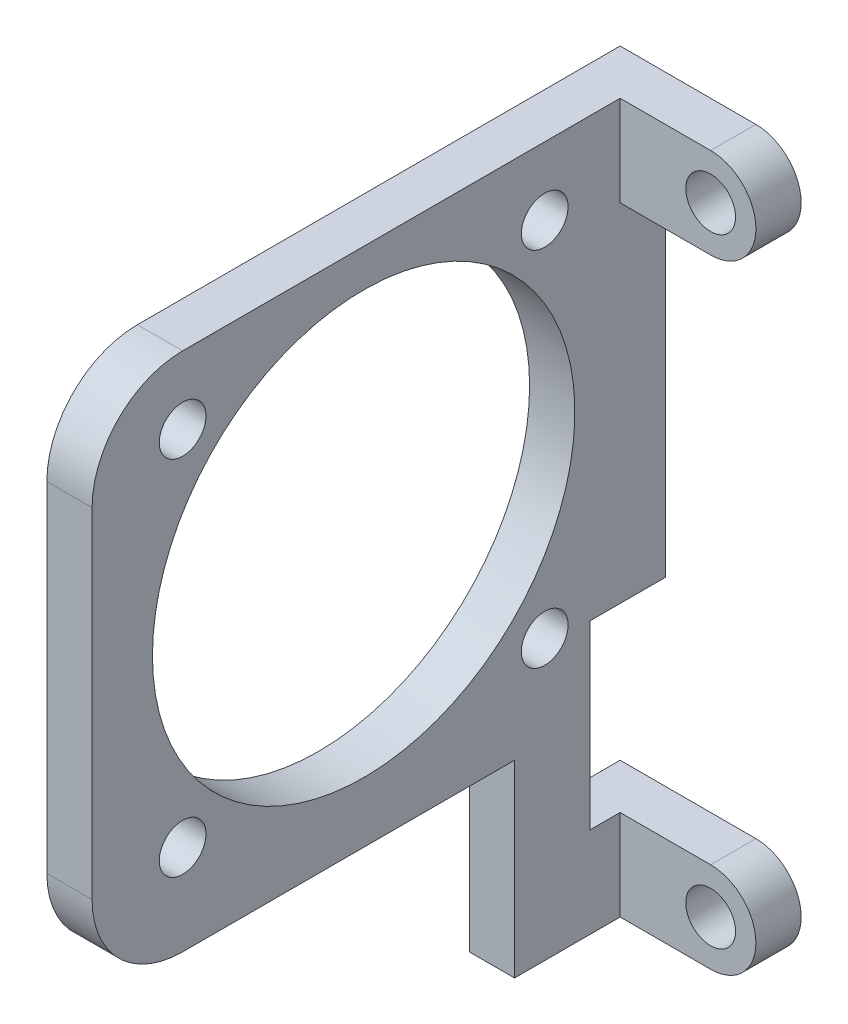
ISO-10303-21;
HEADER;
FILE_DESCRIPTION(('STEP AP214'),'2;1');
FILE_NAME('part.step','',(''),(''),'','','');
FILE_SCHEMA(('AUTOMOTIVE_DESIGN { 1 0 10303 214 1 1 1 1 }'));
ENDSEC;
DATA;
#1=APPLICATION_CONTEXT('core data for automotive mechanical design processes');
#2=APPLICATION_PROTOCOL_DEFINITION('international standard','automotive_design',2000,#1);
#3=PRODUCT_CONTEXT('',#1,'mechanical');
#4=PRODUCT('Part','Part','',(#3));
#5=PRODUCT_RELATED_PRODUCT_CATEGORY('part','',(#4));
#6=PRODUCT_DEFINITION_FORMATION('','',#4);
#7=PRODUCT_DEFINITION_CONTEXT('part definition',#1,'design');
#8=PRODUCT_DEFINITION('design','',#6,#7);
#9=PRODUCT_DEFINITION_SHAPE('','',#8);
#10=(LENGTH_UNIT() NAMED_UNIT(*) SI_UNIT(.MILLI.,.METRE.));
#11=(NAMED_UNIT(*) PLANE_ANGLE_UNIT() SI_UNIT($,.RADIAN.));
#12=(NAMED_UNIT(*) SI_UNIT($,.STERADIAN.) SOLID_ANGLE_UNIT());
#13=UNCERTAINTY_MEASURE_WITH_UNIT(LENGTH_MEASURE(1.E-05),#10,'distance_accuracy_value','');
#14=(GEOMETRIC_REPRESENTATION_CONTEXT(3) GLOBAL_UNCERTAINTY_ASSIGNED_CONTEXT((#13)) GLOBAL_UNIT_ASSIGNED_CONTEXT((#10,
#11,#12)) REPRESENTATION_CONTEXT('',''));
#15=CARTESIAN_POINT('',(0.,0.,0.));
#16=DIRECTION('',(0.,0.,1.));
#17=DIRECTION('',(1.,0.,0.));
#18=AXIS2_PLACEMENT_3D('',#15,#16,#17);
#19=CARTESIAN_POINT('',(0.,20.5,0.));
#20=DIRECTION('',(0.,0.,1.));
#21=DIRECTION('',(1.,0.,0.));
#22=AXIS2_PLACEMENT_3D('',#19,#20,#21);
#23=PLANE('',#22);
#24=CARTESIAN_POINT('',(0.,20.5,0.));
#25=DIRECTION('',(0.,0.,1.));
#26=DIRECTION('',(1.,0.,0.));
#27=AXIS2_PLACEMENT_3D('',#24,#25,#26);
#28=CIRCLE('',#27,1.65);
#29=CARTESIAN_POINT('',(1.65,20.5,0.));
#30=VERTEX_POINT('',#29);
#31=EDGE_CURVE('E271',#30,#30,#28,.T.);
#32=ORIENTED_EDGE('',*,*,#31,.T.);
#33=EDGE_LOOP('',(#32));
#34=FACE_BOUND('',#33,.T.);
#35=DIRECTION('',(0.,1.,0.));
#36=VECTOR('',#35,1.);
#37=CARTESIAN_POINT('',(-6.,-17.5,0.));
#38=LINE('',#37,#36);
#39=CARTESIAN_POINT('',(-6.,-5.5,0.));
#40=VERTEX_POINT('',#39);
#41=CARTESIAN_POINT('',(-6.,17.5,0.));
#42=VERTEX_POINT('',#41);
#43=EDGE_CURVE('E292',#40,#42,#38,.T.);
#44=ORIENTED_EDGE('',*,*,#43,.F.);
#45=DIRECTION('',(-1.,0.,0.));
#46=VECTOR('',#45,1.);
#47=CARTESIAN_POINT('',(49.7584074378026,-5.5,0.));
#48=LINE('',#47,#46);
#49=CARTESIAN_POINT('',(-8.99999999999998,-5.5,0.));
#50=VERTEX_POINT('',#49);
#51=EDGE_CURVE('E161',#40,#50,#48,.T.);
#52=ORIENTED_EDGE('',*,*,#51,.T.);
#53=DIRECTION('',(0.,-1.,0.));
#54=VECTOR('',#53,1.);
#55=CARTESIAN_POINT('',(-9.,23.5,0.));
#56=LINE('',#55,#54);
#57=CARTESIAN_POINT('',(-9.,23.5,0.));
#58=VERTEX_POINT('',#57);
#59=EDGE_CURVE('E281',#58,#50,#56,.T.);
#60=ORIENTED_EDGE('',*,*,#59,.F.);
#61=DIRECTION('',(-1.,0.,0.));
#62=VECTOR('',#61,1.);
#63=CARTESIAN_POINT('',(0.,23.5,0.));
#64=LINE('',#63,#62);
#65=CARTESIAN_POINT('',(0.,23.5,0.));
#66=VERTEX_POINT('',#65);
#67=EDGE_CURVE('E277',#66,#58,#64,.T.);
#68=ORIENTED_EDGE('',*,*,#67,.F.);
#69=CARTESIAN_POINT('',(0.,20.5,0.));
#70=DIRECTION('',(0.,0.,1.));
#71=DIRECTION('',(1.,0.,0.));
#72=AXIS2_PLACEMENT_3D('',#69,#70,#71);
#73=CIRCLE('',#72,3.);
#74=CARTESIAN_POINT('',(0.,17.5,0.));
#75=VERTEX_POINT('',#74);
#76=EDGE_CURVE('E274',#75,#66,#73,.T.);
#77=ORIENTED_EDGE('',*,*,#76,.F.);
#78=DIRECTION('',(1.,0.,0.));
#79=VECTOR('',#78,1.);
#80=CARTESIAN_POINT('',(-6.,17.5,0.));
#81=LINE('',#80,#79);
#82=EDGE_CURVE('E294',#42,#75,#81,.T.);
#83=ORIENTED_EDGE('',*,*,#82,.F.);
#84=EDGE_LOOP('',(#44,#52,#60,#68,#77,#83));
#85=FACE_BOUND('',#84,.T.);
#86=ADVANCED_FACE('F33',(#34,#85),#23,.F.);
#87=CARTESIAN_POINT('',(-8.99999999999998,-17.5,0.));
#88=VERTEX_POINT('',#87);
#89=CARTESIAN_POINT('',(-9.,-23.5,0.));
#90=VERTEX_POINT('',#89);
#91=EDGE_CURVE('E280',#88,#90,#56,.T.);
#92=ORIENTED_EDGE('',*,*,#91,.F.);
#93=DIRECTION('',(-1.,0.,0.));
#94=VECTOR('',#93,1.);
#95=CARTESIAN_POINT('',(0.,-17.5,0.));
#96=LINE('',#95,#94);
#97=CARTESIAN_POINT('',(0.,-17.5,0.));
#98=VERTEX_POINT('',#97);
#99=EDGE_CURVE('E290',#98,#88,#96,.T.);
#100=ORIENTED_EDGE('',*,*,#99,.F.);
#101=CARTESIAN_POINT('',(0.,-20.5,0.));
#102=DIRECTION('',(0.,0.,1.));
#103=DIRECTION('',(1.,0.,0.));
#104=AXIS2_PLACEMENT_3D('',#101,#102,#103);
#105=CIRCLE('',#104,3.);
#106=CARTESIAN_POINT('',(0.,-23.5,0.));
#107=VERTEX_POINT('',#106);
#108=EDGE_CURVE('E287',#107,#98,#105,.T.);
#109=ORIENTED_EDGE('',*,*,#108,.F.);
#110=DIRECTION('',(1.,0.,0.));
#111=VECTOR('',#110,1.);
#112=CARTESIAN_POINT('',(-9.,-23.5,0.));
#113=LINE('',#112,#111);
#114=EDGE_CURVE('E284',#90,#107,#113,.T.);
#115=ORIENTED_EDGE('',*,*,#114,.F.);
#116=EDGE_LOOP('',(#92,#100,#109,#115));
#117=FACE_BOUND('',#116,.T.);
#118=CARTESIAN_POINT('',(0.,-20.5,0.));
#119=DIRECTION('',(0.,0.,1.));
#120=DIRECTION('',(1.,0.,0.));
#121=AXIS2_PLACEMENT_3D('',#118,#119,#120);
#122=CIRCLE('',#121,1.65);
#123=CARTESIAN_POINT('',(1.65,-20.5,0.));
#124=VERTEX_POINT('',#123);
#125=EDGE_CURVE('E268',#124,#124,#122,.T.);
#126=ORIENTED_EDGE('',*,*,#125,.T.);
#127=EDGE_LOOP('',(#126));
#128=FACE_BOUND('',#127,.T.);
#129=ADVANCED_FACE('F348',(#117,#128),#23,.F.);
#130=CARTESIAN_POINT('',(0.,20.5,40.));
#131=DIRECTION('',(0.,0.,-1.));
#132=DIRECTION('',(-1.,0.,0.));
#133=AXIS2_PLACEMENT_3D('',#130,#131,#132);
#134=CYLINDRICAL_SURFACE('',#133,3.);
#135=DIRECTION('',(0.,0.,-1.));
#136=VECTOR('',#135,1.);
#137=CARTESIAN_POINT('',(0.,23.5,40.));
#138=LINE('',#137,#136);
#139=CARTESIAN_POINT('',(0.,23.5,3.));
#140=VERTEX_POINT('',#139);
#141=EDGE_CURVE('E311',#140,#66,#138,.T.);
#142=ORIENTED_EDGE('',*,*,#141,.F.);
#143=CARTESIAN_POINT('',(0.,20.5,3.));
#144=DIRECTION('',(0.,0.,-1.));
#145=DIRECTION('',(-1.,0.,0.));
#146=AXIS2_PLACEMENT_3D('',#143,#144,#145);
#147=CIRCLE('',#146,3.);
#148=CARTESIAN_POINT('',(0.,17.5,3.));
#149=VERTEX_POINT('',#148);
#150=EDGE_CURVE('E261',#140,#149,#147,.T.);
#151=ORIENTED_EDGE('',*,*,#150,.T.);
#152=DIRECTION('',(0.,0.,-1.));
#153=VECTOR('',#152,1.);
#154=CARTESIAN_POINT('',(0.,17.5,40.));
#155=LINE('',#154,#153);
#156=EDGE_CURVE('E297',#149,#75,#155,.T.);
#157=ORIENTED_EDGE('',*,*,#156,.T.);
#158=ORIENTED_EDGE('',*,*,#76,.T.);
#159=EDGE_LOOP('',(#142,#151,#157,#158));
#160=FACE_BOUND('',#159,.T.);
#161=ADVANCED_FACE('F385',(#160),#134,.T.);
#162=CARTESIAN_POINT('',(0.,23.5,40.));
#163=DIRECTION('',(0.,-1.,0.));
#164=DIRECTION('',(0.,0.,-1.));
#165=AXIS2_PLACEMENT_3D('',#162,#163,#164);
#166=PLANE('',#165);
#167=DIRECTION('',(0.,0.,-1.));
#168=VECTOR('',#167,1.);
#169=CARTESIAN_POINT('',(-9.,23.5,40.));
#170=LINE('',#169,#168);
#171=CARTESIAN_POINT('',(-9.,23.5,32.));
#172=VERTEX_POINT('',#171);
#173=EDGE_CURVE('E309',#172,#58,#170,.T.);
#174=ORIENTED_EDGE('',*,*,#173,.F.);
#175=DIRECTION('',(-1.,0.,0.));
#176=VECTOR('',#175,1.);
#177=CARTESIAN_POINT('',(0.,23.5,32.));
#178=LINE('',#177,#176);
#179=CARTESIAN_POINT('',(-6.,23.5,32.));
#180=VERTEX_POINT('',#179);
#181=EDGE_CURVE('E56',#172,#180,#178,.F.);
#182=ORIENTED_EDGE('',*,*,#181,.T.);
#183=DIRECTION('',(0.,0.,-1.));
#184=VECTOR('',#183,1.);
#185=CARTESIAN_POINT('',(-6.,23.5,40.));
#186=LINE('',#185,#184);
#187=CARTESIAN_POINT('',(-6.,23.5,3.));
#188=VERTEX_POINT('',#187);
#189=EDGE_CURVE('E242',#180,#188,#186,.T.);
#190=ORIENTED_EDGE('',*,*,#189,.T.);
#191=DIRECTION('',(1.,0.,0.));
#192=VECTOR('',#191,1.);
#193=CARTESIAN_POINT('',(-6.,23.5,3.));
#194=LINE('',#193,#192);
#195=EDGE_CURVE('E244',#188,#140,#194,.T.);
#196=ORIENTED_EDGE('',*,*,#195,.T.);
#197=ORIENTED_EDGE('',*,*,#141,.T.);
#198=ORIENTED_EDGE('',*,*,#67,.T.);
#199=EDGE_LOOP('',(#174,#182,#190,#196,#197,#198));
#200=FACE_BOUND('',#199,.T.);
#201=ADVANCED_FACE('F336',(#200),#166,.F.);
#202=CARTESIAN_POINT('',(-9.,23.5,40.));
#203=DIRECTION('',(1.,0.,0.));
#204=DIRECTION('',(0.,0.,-1.));
#205=AXIS2_PLACEMENT_3D('',#202,#203,#204);
#206=PLANE('',#205);
#207=CARTESIAN_POINT('',(-8.99999999999999,19.,32.));
#208=DIRECTION('',(1.,0.,0.));
#209=DIRECTION('',(0.,0.,-1.));
#210=AXIS2_PLACEMENT_3D('',#207,#208,#209);
#211=CIRCLE('',#210,1.55);
#212=CARTESIAN_POINT('',(-8.99999999999999,19.,30.45));
#213=VERTEX_POINT('',#212);
#214=EDGE_CURVE('E238',#213,#213,#211,.T.);
#215=ORIENTED_EDGE('',*,*,#214,.T.);
#216=EDGE_LOOP('',(#215));
#217=FACE_BOUND('',#216,.T.);
#218=CARTESIAN_POINT('',(-8.99999999999999,-5.,32.));
#219=DIRECTION('',(1.,0.,0.));
#220=DIRECTION('',(0.,0.,-1.));
#221=AXIS2_PLACEMENT_3D('',#218,#219,#220);
#222=CIRCLE('',#221,1.55);
#223=CARTESIAN_POINT('',(-8.99999999999999,-5.,30.45));
#224=VERTEX_POINT('',#223);
#225=EDGE_CURVE('E235',#224,#224,#222,.T.);
#226=ORIENTED_EDGE('',*,*,#225,.T.);
#227=EDGE_LOOP('',(#226));
#228=FACE_BOUND('',#227,.T.);
#229=CARTESIAN_POINT('',(-8.99999999999999,-5.,8.00000000000001));
#230=DIRECTION('',(1.,0.,0.));
#231=DIRECTION('',(0.,0.,-1.));
#232=AXIS2_PLACEMENT_3D('',#229,#230,#231);
#233=CIRCLE('',#232,1.55);
#234=CARTESIAN_POINT('',(-8.99999999999999,-5.,6.45000000000001));
#235=VERTEX_POINT('',#234);
#236=EDGE_CURVE('E232',#235,#235,#233,.T.);
#237=ORIENTED_EDGE('',*,*,#236,.T.);
#238=EDGE_LOOP('',(#237));
#239=FACE_BOUND('',#238,.T.);
#240=CARTESIAN_POINT('',(-8.99999999999999,19.,8.));
#241=DIRECTION('',(1.,0.,0.));
#242=DIRECTION('',(0.,0.,-1.));
#243=AXIS2_PLACEMENT_3D('',#240,#241,#242);
#244=CIRCLE('',#243,1.55);
#245=CARTESIAN_POINT('',(-8.99999999999999,19.,6.45));
#246=VERTEX_POINT('',#245);
#247=EDGE_CURVE('E229',#246,#246,#244,.T.);
#248=ORIENTED_EDGE('',*,*,#247,.T.);
#249=EDGE_LOOP('',(#248));
#250=FACE_BOUND('',#249,.T.);
#251=CARTESIAN_POINT('',(-8.99999999999999,7.,20.));
#252=DIRECTION('',(1.,0.,0.));
#253=DIRECTION('',(0.,0.,-1.));
#254=AXIS2_PLACEMENT_3D('',#251,#252,#253);
#255=CIRCLE('',#254,14.);
#256=CARTESIAN_POINT('',(-8.99999999999999,7.,6.));
#257=VERTEX_POINT('',#256);
#258=EDGE_CURVE('E211',#257,#257,#255,.T.);
#259=ORIENTED_EDGE('',*,*,#258,.T.);
#260=EDGE_LOOP('',(#259));
#261=FACE_BOUND('',#260,.T.);
#262=DIRECTION('',(0.,1.,0.));
#263=VECTOR('',#262,1.);
#264=CARTESIAN_POINT('',(-9.,23.5,38.));
#265=LINE('',#264,#263);
#266=CARTESIAN_POINT('',(-9.,-5.,38.));
#267=VERTEX_POINT('',#266);
#268=CARTESIAN_POINT('',(-9.,17.5,38.));
#269=VERTEX_POINT('',#268);
#270=EDGE_CURVE('E214',#267,#269,#265,.T.);
#271=ORIENTED_EDGE('',*,*,#270,.T.);
#272=CARTESIAN_POINT('',(-8.99999999999999,17.5,32.));
#273=DIRECTION('',(1.,0.,0.));
#274=DIRECTION('',(0.,0.,-1.));
#275=AXIS2_PLACEMENT_3D('',#272,#273,#274);
#276=CIRCLE('',#275,6.);
#277=EDGE_CURVE('E322',#269,#172,#276,.F.);
#278=ORIENTED_EDGE('',*,*,#277,.T.);
#279=ORIENTED_EDGE('',*,*,#173,.T.);
#280=ORIENTED_EDGE('',*,*,#59,.T.);
#281=DIRECTION('',(0.,0.,1.));
#282=VECTOR('',#281,1.);
#283=CARTESIAN_POINT('',(-9.,-5.49999999999999,40.));
#284=LINE('',#283,#282);
#285=CARTESIAN_POINT('',(-8.99999999999998,-5.5,5.));
#286=VERTEX_POINT('',#285);
#287=EDGE_CURVE('E227',#50,#286,#284,.T.);
#288=ORIENTED_EDGE('',*,*,#287,.T.);
#289=DIRECTION('',(0.,-1.,0.));
#290=VECTOR('',#289,1.);
#291=CARTESIAN_POINT('',(-9.,23.5,5.));
#292=LINE('',#291,#290);
#293=CARTESIAN_POINT('',(-8.99999999999998,-17.5,5.));
#294=VERTEX_POINT('',#293);
#295=EDGE_CURVE('E173',#286,#294,#292,.T.);
#296=ORIENTED_EDGE('',*,*,#295,.T.);
#297=DIRECTION('',(0.,0.,-1.));
#298=VECTOR('',#297,1.);
#299=CARTESIAN_POINT('',(-9.,-17.5,40.));
#300=LINE('',#299,#298);
#301=EDGE_CURVE('E223',#294,#88,#300,.T.);
#302=ORIENTED_EDGE('',*,*,#301,.T.);
#303=ORIENTED_EDGE('',*,*,#91,.T.);
#304=DIRECTION('',(0.,0.,-1.));
#305=VECTOR('',#304,1.);
#306=CARTESIAN_POINT('',(-9.,-23.5,40.));
#307=LINE('',#306,#305);
#308=CARTESIAN_POINT('',(-8.99999999999998,-23.5,10.));
#309=VERTEX_POINT('',#308);
#310=EDGE_CURVE('E306',#309,#90,#307,.T.);
#311=ORIENTED_EDGE('',*,*,#310,.F.);
#312=DIRECTION('',(0.,1.,0.));
#313=VECTOR('',#312,1.);
#314=CARTESIAN_POINT('',(-9.,23.5,9.99999999999999));
#315=LINE('',#314,#313);
#316=CARTESIAN_POINT('',(-8.99999999999998,-11.,10.));
#317=VERTEX_POINT('',#316);
#318=EDGE_CURVE('E220',#309,#317,#315,.T.);
#319=ORIENTED_EDGE('',*,*,#318,.T.);
#320=DIRECTION('',(0.,0.,1.));
#321=VECTOR('',#320,1.);
#322=CARTESIAN_POINT('',(-9.,-11.,40.));
#323=LINE('',#322,#321);
#324=CARTESIAN_POINT('',(-9.,-11.,32.));
#325=VERTEX_POINT('',#324);
#326=EDGE_CURVE('E217',#317,#325,#323,.T.);
#327=ORIENTED_EDGE('',*,*,#326,.T.);
#328=CARTESIAN_POINT('',(-8.99999999999999,-5.,32.));
#329=DIRECTION('',(1.,0.,0.));
#330=DIRECTION('',(0.,0.,-1.));
#331=AXIS2_PLACEMENT_3D('',#328,#329,#330);
#332=CIRCLE('',#331,6.);
#333=EDGE_CURVE('E320',#325,#267,#332,.F.);
#334=ORIENTED_EDGE('',*,*,#333,.T.);
#335=EDGE_LOOP('',(#271,#278,#279,#280,#288,#296,#302,#303,#311,#319,#327,#334));
#336=FACE_BOUND('',#335,.T.);
#337=ADVANCED_FACE('F335',(#217,#228,#239,#250,#261,#336),#206,.F.);
#338=CARTESIAN_POINT('',(-9.,-23.5,40.));
#339=DIRECTION('',(0.,1.,0.));
#340=DIRECTION('',(0.,0.,1.));
#341=AXIS2_PLACEMENT_3D('',#338,#339,#340);
#342=PLANE('',#341);
#343=DIRECTION('',(0.,0.,-1.));
#344=VECTOR('',#343,1.);
#345=CARTESIAN_POINT('',(-6.,-23.5,40.));
#346=LINE('',#345,#344);
#347=CARTESIAN_POINT('',(-6.,-23.5,10.));
#348=VERTEX_POINT('',#347);
#349=CARTESIAN_POINT('',(-6.,-23.5,3.));
#350=VERTEX_POINT('',#349);
#351=EDGE_CURVE('E241',#348,#350,#346,.T.);
#352=ORIENTED_EDGE('',*,*,#351,.F.);
#353=DIRECTION('',(-1.,0.,0.));
#354=VECTOR('',#353,1.);
#355=CARTESIAN_POINT('',(49.7584074378026,-23.5,10.));
#356=LINE('',#355,#354);
#357=EDGE_CURVE('E189',#348,#309,#356,.T.);
#358=ORIENTED_EDGE('',*,*,#357,.T.);
#359=ORIENTED_EDGE('',*,*,#310,.T.);
#360=ORIENTED_EDGE('',*,*,#114,.T.);
#361=DIRECTION('',(0.,0.,-1.));
#362=VECTOR('',#361,1.);
#363=CARTESIAN_POINT('',(0.,-23.5,40.));
#364=LINE('',#363,#362);
#365=CARTESIAN_POINT('',(0.,-23.5,3.));
#366=VERTEX_POINT('',#365);
#367=EDGE_CURVE('E304',#366,#107,#364,.T.);
#368=ORIENTED_EDGE('',*,*,#367,.F.);
#369=DIRECTION('',(1.,0.,0.));
#370=VECTOR('',#369,1.);
#371=CARTESIAN_POINT('',(-6.,-23.5,3.));
#372=LINE('',#371,#370);
#373=EDGE_CURVE('E245',#350,#366,#372,.T.);
#374=ORIENTED_EDGE('',*,*,#373,.F.);
#375=EDGE_LOOP('',(#352,#358,#359,#360,#368,#374));
#376=FACE_BOUND('',#375,.T.);
#377=ADVANCED_FACE('F354',(#376),#342,.F.);
#378=CARTESIAN_POINT('',(0.,-20.5,40.));
#379=DIRECTION('',(0.,0.,-1.));
#380=DIRECTION('',(-1.,0.,0.));
#381=AXIS2_PLACEMENT_3D('',#378,#379,#380);
#382=CYLINDRICAL_SURFACE('',#381,3.);
#383=CARTESIAN_POINT('',(0.,-20.5,3.));
#384=DIRECTION('',(0.,0.,-1.));
#385=DIRECTION('',(-1.,0.,0.));
#386=AXIS2_PLACEMENT_3D('',#383,#384,#385);
#387=CIRCLE('',#386,3.);
#388=CARTESIAN_POINT('',(0.,-17.5,3.));
#389=VERTEX_POINT('',#388);
#390=EDGE_CURVE('E266',#389,#366,#387,.T.);
#391=ORIENTED_EDGE('',*,*,#390,.T.);
#392=ORIENTED_EDGE('',*,*,#367,.T.);
#393=ORIENTED_EDGE('',*,*,#108,.T.);
#394=DIRECTION('',(0.,0.,-1.));
#395=VECTOR('',#394,1.);
#396=CARTESIAN_POINT('',(0.,-17.5,40.));
#397=LINE('',#396,#395);
#398=EDGE_CURVE('E302',#389,#98,#397,.T.);
#399=ORIENTED_EDGE('',*,*,#398,.F.);
#400=EDGE_LOOP('',(#391,#392,#393,#399));
#401=FACE_BOUND('',#400,.T.);
#402=ADVANCED_FACE('F370',(#401),#382,.T.);
#403=CARTESIAN_POINT('',(0.,-17.5,40.));
#404=DIRECTION('',(0.,-1.,0.));
#405=DIRECTION('',(0.,0.,-1.));
#406=AXIS2_PLACEMENT_3D('',#403,#404,#405);
#407=PLANE('',#406);
#408=ORIENTED_EDGE('',*,*,#99,.T.);
#409=ORIENTED_EDGE('',*,*,#301,.F.);
#410=DIRECTION('',(-1.,0.,0.));
#411=VECTOR('',#410,1.);
#412=CARTESIAN_POINT('',(49.7584074378026,-17.5,5.));
#413=LINE('',#412,#411);
#414=CARTESIAN_POINT('',(-6.,-17.5,5.));
#415=VERTEX_POINT('',#414);
#416=EDGE_CURVE('E174',#415,#294,#413,.T.);
#417=ORIENTED_EDGE('',*,*,#416,.F.);
#418=DIRECTION('',(0.,0.,-1.));
#419=VECTOR('',#418,1.);
#420=CARTESIAN_POINT('',(-6.,-17.5,5.));
#421=LINE('',#420,#419);
#422=CARTESIAN_POINT('',(-6.,-17.5,3.));
#423=VERTEX_POINT('',#422);
#424=EDGE_CURVE('E164',#415,#423,#421,.T.);
#425=ORIENTED_EDGE('',*,*,#424,.T.);
#426=DIRECTION('',(1.,0.,0.));
#427=VECTOR('',#426,1.);
#428=CARTESIAN_POINT('',(0.,-17.5,3.));
#429=LINE('',#428,#427);
#430=EDGE_CURVE('E263',#423,#389,#429,.T.);
#431=ORIENTED_EDGE('',*,*,#430,.T.);
#432=ORIENTED_EDGE('',*,*,#398,.T.);
#433=EDGE_LOOP('',(#408,#409,#417,#425,#431,#432));
#434=FACE_BOUND('',#433,.T.);
#435=ADVANCED_FACE('F368',(#434),#407,.F.);
#436=CARTESIAN_POINT('',(-6.,-17.5,40.));
#437=DIRECTION('',(-1.,0.,0.));
#438=DIRECTION('',(0.,0.,1.));
#439=AXIS2_PLACEMENT_3D('',#436,#437,#438);
#440=PLANE('',#439);
#441=CARTESIAN_POINT('',(-6.,19.,32.));
#442=DIRECTION('',(-1.,0.,0.));
#443=DIRECTION('',(0.,0.,1.));
#444=AXIS2_PLACEMENT_3D('',#441,#442,#443);
#445=CIRCLE('',#444,1.55);
#446=CARTESIAN_POINT('',(-6.,19.,33.55));
#447=VERTEX_POINT('',#446);
#448=EDGE_CURVE('E197',#447,#447,#445,.F.);
#449=ORIENTED_EDGE('',*,*,#448,.F.);
#450=EDGE_LOOP('',(#449));
#451=FACE_BOUND('',#450,.T.);
#452=CARTESIAN_POINT('',(-6.,-5.,32.));
#453=DIRECTION('',(-1.,0.,0.));
#454=DIRECTION('',(0.,0.,1.));
#455=AXIS2_PLACEMENT_3D('',#452,#453,#454);
#456=CIRCLE('',#455,1.55);
#457=CARTESIAN_POINT('',(-6.,-5.,33.55));
#458=VERTEX_POINT('',#457);
#459=EDGE_CURVE('E201',#458,#458,#456,.F.);
#460=ORIENTED_EDGE('',*,*,#459,.F.);
#461=EDGE_LOOP('',(#460));
#462=FACE_BOUND('',#461,.T.);
#463=CARTESIAN_POINT('',(-6.,-5.,8.00000000000001));
#464=DIRECTION('',(-1.,0.,0.));
#465=DIRECTION('',(0.,0.,1.));
#466=AXIS2_PLACEMENT_3D('',#463,#464,#465);
#467=CIRCLE('',#466,1.55);
#468=CARTESIAN_POINT('',(-6.,-5.,9.55000000000001));
#469=VERTEX_POINT('',#468);
#470=EDGE_CURVE('E204',#469,#469,#467,.F.);
#471=ORIENTED_EDGE('',*,*,#470,.F.);
#472=EDGE_LOOP('',(#471));
#473=FACE_BOUND('',#472,.T.);
#474=CARTESIAN_POINT('',(-6.,19.,8.));
#475=DIRECTION('',(-1.,0.,0.));
#476=DIRECTION('',(0.,0.,1.));
#477=AXIS2_PLACEMENT_3D('',#474,#475,#476);
#478=CIRCLE('',#477,1.55);
#479=CARTESIAN_POINT('',(-6.,19.,9.55));
#480=VERTEX_POINT('',#479);
#481=EDGE_CURVE('E184',#480,#480,#478,.F.);
#482=ORIENTED_EDGE('',*,*,#481,.F.);
#483=EDGE_LOOP('',(#482));
#484=FACE_BOUND('',#483,.T.);
#485=CARTESIAN_POINT('',(-6.,7.,20.));
#486=DIRECTION('',(-1.,0.,0.));
#487=DIRECTION('',(0.,0.,1.));
#488=AXIS2_PLACEMENT_3D('',#485,#486,#487);
#489=CIRCLE('',#488,14.);
#490=CARTESIAN_POINT('',(-6.,7.,34.));
#491=VERTEX_POINT('',#490);
#492=EDGE_CURVE('E200',#491,#491,#489,.F.);
#493=ORIENTED_EDGE('',*,*,#492,.F.);
#494=EDGE_LOOP('',(#493));
#495=FACE_BOUND('',#494,.T.);
#496=ORIENTED_EDGE('',*,*,#189,.F.);
#497=CARTESIAN_POINT('',(-6.,17.5,32.));
#498=DIRECTION('',(-1.,0.,0.));
#499=DIRECTION('',(0.,0.,1.));
#500=AXIS2_PLACEMENT_3D('',#497,#498,#499);
#501=CIRCLE('',#500,6.);
#502=CARTESIAN_POINT('',(-6.,17.5,38.));
#503=VERTEX_POINT('',#502);
#504=EDGE_CURVE('E41',#180,#503,#501,.F.);
#505=ORIENTED_EDGE('',*,*,#504,.T.);
#506=DIRECTION('',(0.,1.,0.));
#507=VECTOR('',#506,1.);
#508=CARTESIAN_POINT('',(-6.,23.5,38.));
#509=LINE('',#508,#507);
#510=CARTESIAN_POINT('',(-6.,-5.,38.));
#511=VERTEX_POINT('',#510);
#512=EDGE_CURVE('E185',#511,#503,#509,.T.);
#513=ORIENTED_EDGE('',*,*,#512,.F.);
#514=CARTESIAN_POINT('',(-6.,-5.,32.));
#515=DIRECTION('',(-1.,0.,0.));
#516=DIRECTION('',(0.,0.,1.));
#517=AXIS2_PLACEMENT_3D('',#514,#515,#516);
#518=CIRCLE('',#517,6.);
#519=CARTESIAN_POINT('',(-6.,-11.,32.));
#520=VERTEX_POINT('',#519);
#521=EDGE_CURVE('E48',#511,#520,#518,.F.);
#522=ORIENTED_EDGE('',*,*,#521,.T.);
#523=DIRECTION('',(0.,0.,1.));
#524=VECTOR('',#523,1.);
#525=CARTESIAN_POINT('',(-6.,-11.,10.));
#526=LINE('',#525,#524);
#527=CARTESIAN_POINT('',(-6.,-11.,10.));
#528=VERTEX_POINT('',#527);
#529=EDGE_CURVE('E188',#528,#520,#526,.T.);
#530=ORIENTED_EDGE('',*,*,#529,.F.);
#531=DIRECTION('',(0.,1.,0.));
#532=VECTOR('',#531,1.);
#533=CARTESIAN_POINT('',(-6.,-23.5,10.));
#534=LINE('',#533,#532);
#535=EDGE_CURVE('E182',#348,#528,#534,.T.);
#536=ORIENTED_EDGE('',*,*,#535,.F.);
#537=ORIENTED_EDGE('',*,*,#351,.T.);
#538=DIRECTION('',(0.,-1.,0.));
#539=VECTOR('',#538,1.);
#540=CARTESIAN_POINT('',(-6.,23.5,3.));
#541=LINE('',#540,#539);
#542=EDGE_CURVE('E248',#423,#350,#541,.T.);
#543=ORIENTED_EDGE('',*,*,#542,.F.);
#544=ORIENTED_EDGE('',*,*,#424,.F.);
#545=DIRECTION('',(0.,-1.,0.));
#546=VECTOR('',#545,1.);
#547=CARTESIAN_POINT('',(-6.,-5.5,5.));
#548=LINE('',#547,#546);
#549=CARTESIAN_POINT('',(-6.,-5.5,5.));
#550=VERTEX_POINT('',#549);
#551=EDGE_CURVE('E165',#550,#415,#548,.T.);
#552=ORIENTED_EDGE('',*,*,#551,.F.);
#553=DIRECTION('',(0.,0.,1.));
#554=VECTOR('',#553,1.);
#555=CARTESIAN_POINT('',(-6.,-5.5,5.));
#556=LINE('',#555,#554);
#557=EDGE_CURVE('E155',#40,#550,#556,.T.);
#558=ORIENTED_EDGE('',*,*,#557,.F.);
#559=ORIENTED_EDGE('',*,*,#43,.T.);
#560=DIRECTION('',(0.,0.,-1.));
#561=VECTOR('',#560,1.);
#562=CARTESIAN_POINT('',(-6.,17.5,40.));
#563=LINE('',#562,#561);
#564=CARTESIAN_POINT('',(-6.,17.5,3.));
#565=VERTEX_POINT('',#564);
#566=EDGE_CURVE('E299',#565,#42,#563,.T.);
#567=ORIENTED_EDGE('',*,*,#566,.F.);
#568=EDGE_CURVE('E252',#188,#565,#541,.T.);
#569=ORIENTED_EDGE('',*,*,#568,.F.);
#570=EDGE_LOOP('',(#496,#505,#513,#522,#530,#536,#537,#543,#544,#552,#558,#559,#567,#569));
#571=FACE_BOUND('',#570,.T.);
#572=ADVANCED_FACE('F176',(#451,#462,#473,#484,#495,#571),#440,.F.);
#573=CARTESIAN_POINT('',(-6.,17.5,40.));
#574=DIRECTION('',(0.,1.,0.));
#575=DIRECTION('',(0.,0.,1.));
#576=AXIS2_PLACEMENT_3D('',#573,#574,#575);
#577=PLANE('',#576);
#578=ORIENTED_EDGE('',*,*,#156,.F.);
#579=DIRECTION('',(-1.,0.,0.));
#580=VECTOR('',#579,1.);
#581=CARTESIAN_POINT('',(-6.,17.5,3.));
#582=LINE('',#581,#580);
#583=EDGE_CURVE('E258',#149,#565,#582,.T.);
#584=ORIENTED_EDGE('',*,*,#583,.T.);
#585=ORIENTED_EDGE('',*,*,#566,.T.);
#586=ORIENTED_EDGE('',*,*,#82,.T.);
#587=EDGE_LOOP('',(#578,#584,#585,#586));
#588=FACE_BOUND('',#587,.T.);
#589=ADVANCED_FACE('F390',(#588),#577,.F.);
#590=CARTESIAN_POINT('',(0.,20.5,40.));
#591=DIRECTION('',(0.,0.,-1.));
#592=DIRECTION('',(-1.,0.,0.));
#593=AXIS2_PLACEMENT_3D('',#590,#591,#592);
#594=CYLINDRICAL_SURFACE('',#593,1.65);
#595=CARTESIAN_POINT('',(0.,20.5,3.));
#596=DIRECTION('',(0.,0.,-1.));
#597=DIRECTION('',(-1.,0.,0.));
#598=AXIS2_PLACEMENT_3D('',#595,#596,#597);
#599=CIRCLE('',#598,1.65);
#600=CARTESIAN_POINT('',(-1.65,20.5,3.));
#601=VERTEX_POINT('',#600);
#602=EDGE_CURVE('E255',#601,#601,#599,.T.);
#603=ORIENTED_EDGE('',*,*,#602,.F.);
#604=EDGE_LOOP('',(#603));
#605=FACE_BOUND('',#604,.T.);
#606=ORIENTED_EDGE('',*,*,#31,.F.);
#607=EDGE_LOOP('',(#606));
#608=FACE_BOUND('',#607,.T.);
#609=ADVANCED_FACE('F388',(#605,#608),#594,.F.);
#610=CARTESIAN_POINT('',(0.,-20.5,40.));
#611=DIRECTION('',(0.,0.,-1.));
#612=DIRECTION('',(-1.,0.,0.));
#613=AXIS2_PLACEMENT_3D('',#610,#611,#612);
#614=CYLINDRICAL_SURFACE('',#613,1.65);
#615=CARTESIAN_POINT('',(0.,-20.5,3.));
#616=DIRECTION('',(0.,0.,-1.));
#617=DIRECTION('',(-1.,0.,0.));
#618=AXIS2_PLACEMENT_3D('',#615,#616,#617);
#619=CIRCLE('',#618,1.65);
#620=CARTESIAN_POINT('',(-1.65,-20.5,3.));
#621=VERTEX_POINT('',#620);
#622=EDGE_CURVE('E254',#621,#621,#619,.T.);
#623=ORIENTED_EDGE('',*,*,#622,.F.);
#624=EDGE_LOOP('',(#623));
#625=FACE_BOUND('',#624,.T.);
#626=ORIENTED_EDGE('',*,*,#125,.F.);
#627=EDGE_LOOP('',(#626));
#628=FACE_BOUND('',#627,.T.);
#629=ADVANCED_FACE('F454',(#625,#628),#614,.F.);
#630=CARTESIAN_POINT('',(-6.,23.5,3.));
#631=DIRECTION('',(0.,0.,-1.));
#632=DIRECTION('',(-1.,0.,0.));
#633=AXIS2_PLACEMENT_3D('',#630,#631,#632);
#634=PLANE('',#633);
#635=ORIENTED_EDGE('',*,*,#622,.T.);
#636=EDGE_LOOP('',(#635));
#637=FACE_BOUND('',#636,.T.);
#638=ORIENTED_EDGE('',*,*,#390,.F.);
#639=ORIENTED_EDGE('',*,*,#430,.F.);
#640=ORIENTED_EDGE('',*,*,#542,.T.);
#641=ORIENTED_EDGE('',*,*,#373,.T.);
#642=EDGE_LOOP('',(#638,#639,#640,#641));
#643=FACE_BOUND('',#642,.T.);
#644=ADVANCED_FACE('F365',(#637,#643),#634,.F.);
#645=ORIENTED_EDGE('',*,*,#602,.T.);
#646=EDGE_LOOP('',(#645));
#647=FACE_BOUND('',#646,.T.);
#648=ORIENTED_EDGE('',*,*,#195,.F.);
#649=ORIENTED_EDGE('',*,*,#568,.T.);
#650=ORIENTED_EDGE('',*,*,#583,.F.);
#651=ORIENTED_EDGE('',*,*,#150,.F.);
#652=EDGE_LOOP('',(#648,#649,#650,#651));
#653=FACE_BOUND('',#652,.T.);
#654=ADVANCED_FACE('F411',(#647,#653),#634,.F.);
#655=CARTESIAN_POINT('',(49.7584074378026,7.,20.));
#656=DIRECTION('',(-1.,0.,0.));
#657=DIRECTION('',(0.,0.,1.));
#658=AXIS2_PLACEMENT_3D('',#655,#656,#657);
#659=CYLINDRICAL_SURFACE('',#658,14.);
#660=ORIENTED_EDGE('',*,*,#492,.T.);
#661=EDGE_LOOP('',(#660));
#662=FACE_BOUND('',#661,.T.);
#663=ORIENTED_EDGE('',*,*,#258,.F.);
#664=EDGE_LOOP('',(#663));
#665=FACE_BOUND('',#664,.T.);
#666=ADVANCED_FACE('F408',(#662,#665),#659,.F.);
#667=CARTESIAN_POINT('',(49.7584074378026,-23.5,10.));
#668=DIRECTION('',(0.,0.,-1.));
#669=DIRECTION('',(0.,1.,0.));
#670=AXIS2_PLACEMENT_3D('',#667,#668,#669);
#671=PLANE('',#670);
#672=ORIENTED_EDGE('',*,*,#357,.F.);
#673=ORIENTED_EDGE('',*,*,#535,.T.);
#674=DIRECTION('',(-1.,0.,0.));
#675=VECTOR('',#674,1.);
#676=CARTESIAN_POINT('',(49.7584074378026,-11.,10.));
#677=LINE('',#676,#675);
#678=EDGE_CURVE('E194',#528,#317,#677,.T.);
#679=ORIENTED_EDGE('',*,*,#678,.T.);
#680=ORIENTED_EDGE('',*,*,#318,.F.);
#681=EDGE_LOOP('',(#672,#673,#679,#680));
#682=FACE_BOUND('',#681,.T.);
#683=ADVANCED_FACE('F357',(#682),#671,.F.);
#684=CARTESIAN_POINT('',(49.7584074378026,-11.,10.));
#685=DIRECTION('',(0.,1.,0.));
#686=DIRECTION('',(0.,0.,1.));
#687=AXIS2_PLACEMENT_3D('',#684,#685,#686);
#688=PLANE('',#687);
#689=ORIENTED_EDGE('',*,*,#529,.T.);
#690=DIRECTION('',(-1.,0.,0.));
#691=VECTOR('',#690,1.);
#692=CARTESIAN_POINT('',(49.7584074378026,-11.,32.));
#693=LINE('',#692,#691);
#694=EDGE_CURVE('E11',#520,#325,#693,.T.);
#695=ORIENTED_EDGE('',*,*,#694,.T.);
#696=ORIENTED_EDGE('',*,*,#326,.F.);
#697=ORIENTED_EDGE('',*,*,#678,.F.);
#698=EDGE_LOOP('',(#689,#695,#696,#697));
#699=FACE_BOUND('',#698,.T.);
#700=ADVANCED_FACE('F361',(#699),#688,.F.);
#701=CARTESIAN_POINT('',(49.7584074378026,23.5,38.));
#702=DIRECTION('',(0.,0.,-1.));
#703=DIRECTION('',(-1.,0.,0.));
#704=AXIS2_PLACEMENT_3D('',#701,#702,#703);
#705=PLANE('',#704);
#706=ORIENTED_EDGE('',*,*,#512,.T.);
#707=DIRECTION('',(-1.,0.,0.));
#708=VECTOR('',#707,1.);
#709=CARTESIAN_POINT('',(49.7584074378026,17.5,38.));
#710=LINE('',#709,#708);
#711=EDGE_CURVE('E317',#503,#269,#710,.T.);
#712=ORIENTED_EDGE('',*,*,#711,.T.);
#713=ORIENTED_EDGE('',*,*,#270,.F.);
#714=DIRECTION('',(-1.,0.,0.));
#715=VECTOR('',#714,1.);
#716=CARTESIAN_POINT('',(49.7584074378026,-5.,38.));
#717=LINE('',#716,#715);
#718=EDGE_CURVE('E313',#267,#511,#717,.F.);
#719=ORIENTED_EDGE('',*,*,#718,.T.);
#720=EDGE_LOOP('',(#706,#712,#713,#719));
#721=FACE_BOUND('',#720,.T.);
#722=ADVANCED_FACE('F330',(#721),#705,.F.);
#723=CARTESIAN_POINT('',(49.7584074378026,-5.5,5.));
#724=DIRECTION('',(0.,1.,0.));
#725=DIRECTION('',(0.,0.,1.));
#726=AXIS2_PLACEMENT_3D('',#723,#724,#725);
#727=PLANE('',#726);
#728=ORIENTED_EDGE('',*,*,#51,.F.);
#729=ORIENTED_EDGE('',*,*,#557,.T.);
#730=DIRECTION('',(-1.,0.,0.));
#731=VECTOR('',#730,1.);
#732=CARTESIAN_POINT('',(49.7584074378026,-5.5,5.));
#733=LINE('',#732,#731);
#734=EDGE_CURVE('E158',#550,#286,#733,.T.);
#735=ORIENTED_EDGE('',*,*,#734,.T.);
#736=ORIENTED_EDGE('',*,*,#287,.F.);
#737=EDGE_LOOP('',(#728,#729,#735,#736));
#738=FACE_BOUND('',#737,.T.);
#739=ADVANCED_FACE('F157',(#738),#727,.F.);
#740=CARTESIAN_POINT('',(49.7584074378026,-5.5,5.));
#741=DIRECTION('',(0.,0.,1.));
#742=DIRECTION('',(0.,-1.,0.));
#743=AXIS2_PLACEMENT_3D('',#740,#741,#742);
#744=PLANE('',#743);
#745=ORIENTED_EDGE('',*,*,#734,.F.);
#746=ORIENTED_EDGE('',*,*,#551,.T.);
#747=ORIENTED_EDGE('',*,*,#416,.T.);
#748=ORIENTED_EDGE('',*,*,#295,.F.);
#749=EDGE_LOOP('',(#745,#746,#747,#748));
#750=FACE_BOUND('',#749,.T.);
#751=ADVANCED_FACE('F169',(#750),#744,.F.);
#752=CARTESIAN_POINT('',(49.7584074378026,19.,8.));
#753=DIRECTION('',(-1.,0.,0.));
#754=DIRECTION('',(0.,0.,1.));
#755=AXIS2_PLACEMENT_3D('',#752,#753,#754);
#756=CYLINDRICAL_SURFACE('',#755,1.55);
#757=ORIENTED_EDGE('',*,*,#481,.T.);
#758=EDGE_LOOP('',(#757));
#759=FACE_BOUND('',#758,.T.);
#760=ORIENTED_EDGE('',*,*,#247,.F.);
#761=EDGE_LOOP('',(#760));
#762=FACE_BOUND('',#761,.T.);
#763=ADVANCED_FACE('F448',(#759,#762),#756,.F.);
#764=CARTESIAN_POINT('',(49.7584074378026,-5.,8.00000000000001));
#765=DIRECTION('',(-1.,0.,0.));
#766=DIRECTION('',(0.,0.,1.));
#767=AXIS2_PLACEMENT_3D('',#764,#765,#766);
#768=CYLINDRICAL_SURFACE('',#767,1.55);
#769=ORIENTED_EDGE('',*,*,#470,.T.);
#770=EDGE_LOOP('',(#769));
#771=FACE_BOUND('',#770,.T.);
#772=ORIENTED_EDGE('',*,*,#236,.F.);
#773=EDGE_LOOP('',(#772));
#774=FACE_BOUND('',#773,.T.);
#775=ADVANCED_FACE('F439',(#771,#774),#768,.F.);
#776=CARTESIAN_POINT('',(49.7584074378026,-5.,32.));
#777=DIRECTION('',(-1.,0.,0.));
#778=DIRECTION('',(0.,0.,1.));
#779=AXIS2_PLACEMENT_3D('',#776,#777,#778);
#780=CYLINDRICAL_SURFACE('',#779,1.55);
#781=ORIENTED_EDGE('',*,*,#459,.T.);
#782=EDGE_LOOP('',(#781));
#783=FACE_BOUND('',#782,.T.);
#784=ORIENTED_EDGE('',*,*,#225,.F.);
#785=EDGE_LOOP('',(#784));
#786=FACE_BOUND('',#785,.T.);
#787=ADVANCED_FACE('F433',(#783,#786),#780,.F.);
#788=CARTESIAN_POINT('',(49.7584074378026,19.,32.));
#789=DIRECTION('',(-1.,0.,0.));
#790=DIRECTION('',(0.,0.,1.));
#791=AXIS2_PLACEMENT_3D('',#788,#789,#790);
#792=CYLINDRICAL_SURFACE('',#791,1.55);
#793=ORIENTED_EDGE('',*,*,#448,.T.);
#794=EDGE_LOOP('',(#793));
#795=FACE_BOUND('',#794,.T.);
#796=ORIENTED_EDGE('',*,*,#214,.F.);
#797=EDGE_LOOP('',(#796));
#798=FACE_BOUND('',#797,.T.);
#799=ADVANCED_FACE('F427',(#795,#798),#792,.F.);
#800=CARTESIAN_POINT('',(49.7584074378026,17.5,32.));
#801=DIRECTION('',(-1.,0.,0.));
#802=DIRECTION('',(0.,0.,1.));
#803=AXIS2_PLACEMENT_3D('',#800,#801,#802);
#804=CYLINDRICAL_SURFACE('',#803,6.);
#805=ORIENTED_EDGE('',*,*,#504,.F.);
#806=ORIENTED_EDGE('',*,*,#181,.F.);
#807=ORIENTED_EDGE('',*,*,#277,.F.);
#808=ORIENTED_EDGE('',*,*,#711,.F.);
#809=EDGE_LOOP('',(#805,#806,#807,#808));
#810=FACE_BOUND('',#809,.T.);
#811=ADVANCED_FACE('F333',(#810),#804,.T.);
#812=CARTESIAN_POINT('',(49.7584074378026,-5.,32.));
#813=DIRECTION('',(-1.,0.,0.));
#814=DIRECTION('',(0.,0.,1.));
#815=AXIS2_PLACEMENT_3D('',#812,#813,#814);
#816=CYLINDRICAL_SURFACE('',#815,6.);
#817=ORIENTED_EDGE('',*,*,#521,.F.);
#818=ORIENTED_EDGE('',*,*,#718,.F.);
#819=ORIENTED_EDGE('',*,*,#333,.F.);
#820=ORIENTED_EDGE('',*,*,#694,.F.);
#821=EDGE_LOOP('',(#817,#818,#819,#820));
#822=FACE_BOUND('',#821,.T.);
#823=ADVANCED_FACE('F35',(#822),#816,.T.);
#824=CLOSED_SHELL('',(#86,#129,#161,#201,#337,#377,#402,#435,#572,#589,#609,#629,#644,#654,#666,
#683,#700,#722,#739,#751,#763,#775,#787,#799,#811,#823));
#825=MANIFOLD_SOLID_BREP('B2',#824);
#826=ADVANCED_BREP_SHAPE_REPRESENTATION('',(#18,#825),#14);
#827=SHAPE_DEFINITION_REPRESENTATION(#9,#826);
ENDSEC;
END-ISO-10303-21;
